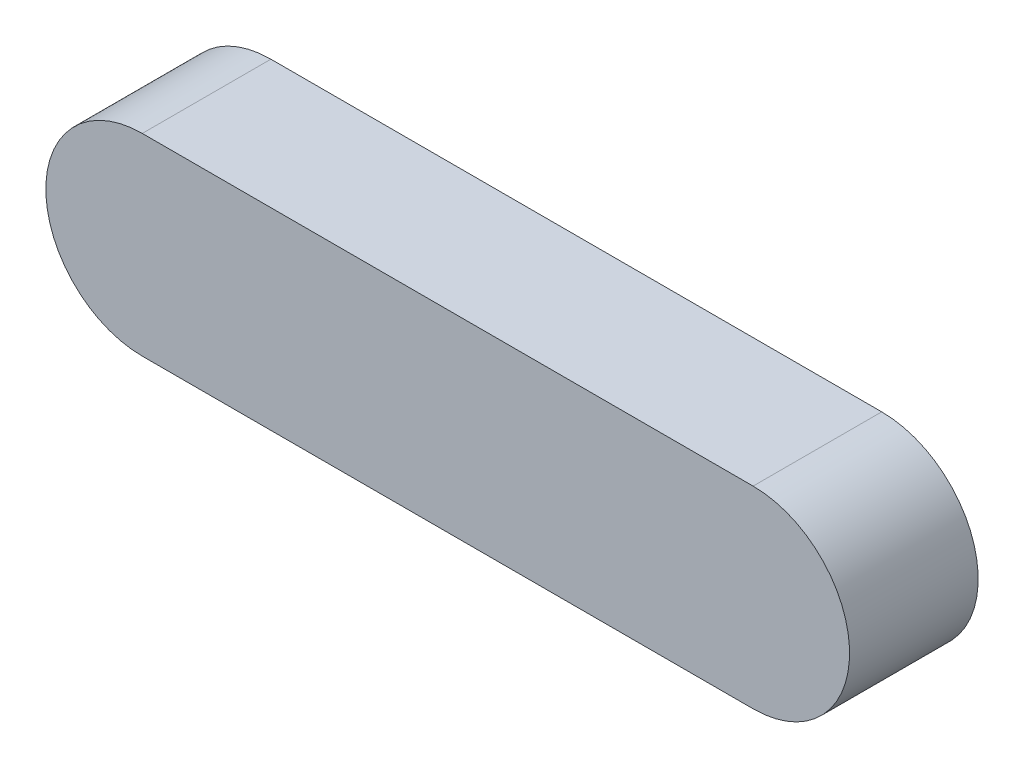
ISO-10303-21;
HEADER;
FILE_DESCRIPTION(('STEP AP214'),'2;1');
FILE_NAME('part.step','',(''),(''),'','','');
FILE_SCHEMA(('AUTOMOTIVE_DESIGN { 1 0 10303 214 1 1 1 1 }'));
ENDSEC;
DATA;
#1=APPLICATION_CONTEXT('core data for automotive mechanical design processes');
#2=APPLICATION_PROTOCOL_DEFINITION('international standard','automotive_design',2000,#1);
#3=PRODUCT_CONTEXT('',#1,'mechanical');
#4=PRODUCT('Part','Part','',(#3));
#5=PRODUCT_RELATED_PRODUCT_CATEGORY('part','',(#4));
#6=PRODUCT_DEFINITION_FORMATION('','',#4);
#7=PRODUCT_DEFINITION_CONTEXT('part definition',#1,'design');
#8=PRODUCT_DEFINITION('design','',#6,#7);
#9=PRODUCT_DEFINITION_SHAPE('','',#8);
#10=(LENGTH_UNIT() NAMED_UNIT(*) SI_UNIT(.MILLI.,.METRE.));
#11=(NAMED_UNIT(*) PLANE_ANGLE_UNIT() SI_UNIT($,.RADIAN.));
#12=(NAMED_UNIT(*) SI_UNIT($,.STERADIAN.) SOLID_ANGLE_UNIT());
#13=UNCERTAINTY_MEASURE_WITH_UNIT(LENGTH_MEASURE(1.E-05),#10,'distance_accuracy_value','');
#14=(GEOMETRIC_REPRESENTATION_CONTEXT(3) GLOBAL_UNCERTAINTY_ASSIGNED_CONTEXT((#13)) GLOBAL_UNIT_ASSIGNED_CONTEXT((#10,
#11,#12)) REPRESENTATION_CONTEXT('',''));
#15=CARTESIAN_POINT('',(0.,0.,0.));
#16=DIRECTION('',(0.,0.,1.));
#17=DIRECTION('',(1.,0.,0.));
#18=AXIS2_PLACEMENT_3D('',#15,#16,#17);
#19=CARTESIAN_POINT('',(-19.,0.,8.));
#20=DIRECTION('',(0.,0.,-1.));
#21=DIRECTION('',(-1.,0.,0.));
#22=AXIS2_PLACEMENT_3D('',#19,#20,#21);
#23=CYLINDRICAL_SURFACE('',#22,6.);
#24=CARTESIAN_POINT('',(-19.,0.,0.));
#25=DIRECTION('',(0.,0.,1.));
#26=DIRECTION('',(1.,0.,0.));
#27=AXIS2_PLACEMENT_3D('',#24,#25,#26);
#28=CIRCLE('',#27,6.);
#29=CARTESIAN_POINT('',(-19.,6.,0.));
#30=VERTEX_POINT('',#29);
#31=CARTESIAN_POINT('',(-19.,-6.,0.));
#32=VERTEX_POINT('',#31);
#33=EDGE_CURVE('E84',#30,#32,#28,.T.);
#34=ORIENTED_EDGE('',*,*,#33,.T.);
#35=DIRECTION('',(0.,0.,-1.));
#36=VECTOR('',#35,1.);
#37=CARTESIAN_POINT('',(-19.,-6.,8.));
#38=LINE('',#37,#36);
#39=CARTESIAN_POINT('',(-19.,-6.,8.));
#40=VERTEX_POINT('',#39);
#41=EDGE_CURVE('E11',#40,#32,#38,.T.);
#42=ORIENTED_EDGE('',*,*,#41,.F.);
#43=CARTESIAN_POINT('',(-19.,0.,8.));
#44=DIRECTION('',(0.,0.,1.));
#45=DIRECTION('',(1.,0.,0.));
#46=AXIS2_PLACEMENT_3D('',#43,#44,#45);
#47=CIRCLE('',#46,6.);
#48=CARTESIAN_POINT('',(-19.,6.,8.));
#49=VERTEX_POINT('',#48);
#50=EDGE_CURVE('E100',#49,#40,#47,.T.);
#51=ORIENTED_EDGE('',*,*,#50,.F.);
#52=DIRECTION('',(0.,0.,-1.));
#53=VECTOR('',#52,1.);
#54=CARTESIAN_POINT('',(-19.,6.,8.));
#55=LINE('',#54,#53);
#56=EDGE_CURVE('E44',#49,#30,#55,.T.);
#57=ORIENTED_EDGE('',*,*,#56,.T.);
#58=EDGE_LOOP('',(#34,#42,#51,#57));
#59=FACE_BOUND('',#58,.T.);
#60=ADVANCED_FACE('F36',(#59),#23,.T.);
#61=CARTESIAN_POINT('',(0.,-6.,8.));
#62=DIRECTION('',(0.,1.,0.));
#63=DIRECTION('',(-1.,0.,0.));
#64=AXIS2_PLACEMENT_3D('',#61,#62,#63);
#65=PLANE('',#64);
#66=DIRECTION('',(1.,0.,0.));
#67=VECTOR('',#66,1.);
#68=CARTESIAN_POINT('',(0.,-6.,0.));
#69=LINE('',#68,#67);
#70=CARTESIAN_POINT('',(19.,-6.,0.));
#71=VERTEX_POINT('',#70);
#72=EDGE_CURVE('E64',#32,#71,#69,.T.);
#73=ORIENTED_EDGE('',*,*,#72,.T.);
#74=DIRECTION('',(0.,0.,-1.));
#75=VECTOR('',#74,1.);
#76=CARTESIAN_POINT('',(19.,-6.,8.));
#77=LINE('',#76,#75);
#78=CARTESIAN_POINT('',(19.,-6.,8.));
#79=VERTEX_POINT('',#78);
#80=EDGE_CURVE('E79',#79,#71,#77,.T.);
#81=ORIENTED_EDGE('',*,*,#80,.F.);
#82=DIRECTION('',(1.,0.,0.));
#83=VECTOR('',#82,1.);
#84=CARTESIAN_POINT('',(0.,-6.,8.));
#85=LINE('',#84,#83);
#86=EDGE_CURVE('E69',#40,#79,#85,.T.);
#87=ORIENTED_EDGE('',*,*,#86,.F.);
#88=ORIENTED_EDGE('',*,*,#41,.T.);
#89=EDGE_LOOP('',(#73,#81,#87,#88));
#90=FACE_BOUND('',#89,.T.);
#91=ADVANCED_FACE('F78',(#90),#65,.F.);
#92=CARTESIAN_POINT('',(-19.,6.,8.));
#93=DIRECTION('',(0.,-1.,0.));
#94=DIRECTION('',(1.,0.,0.));
#95=AXIS2_PLACEMENT_3D('',#92,#93,#94);
#96=PLANE('',#95);
#97=DIRECTION('',(-1.,0.,0.));
#98=VECTOR('',#97,1.);
#99=CARTESIAN_POINT('',(-19.,6.,0.));
#100=LINE('',#99,#98);
#101=CARTESIAN_POINT('',(19.,6.,0.));
#102=VERTEX_POINT('',#101);
#103=EDGE_CURVE('E83',#102,#30,#100,.T.);
#104=ORIENTED_EDGE('',*,*,#103,.T.);
#105=ORIENTED_EDGE('',*,*,#56,.F.);
#106=DIRECTION('',(-1.,0.,0.));
#107=VECTOR('',#106,1.);
#108=CARTESIAN_POINT('',(-19.,6.,8.));
#109=LINE('',#108,#107);
#110=CARTESIAN_POINT('',(19.,6.,8.));
#111=VERTEX_POINT('',#110);
#112=EDGE_CURVE('E52',#111,#49,#109,.T.);
#113=ORIENTED_EDGE('',*,*,#112,.F.);
#114=DIRECTION('',(0.,0.,-1.));
#115=VECTOR('',#114,1.);
#116=CARTESIAN_POINT('',(19.,6.,8.));
#117=LINE('',#116,#115);
#118=EDGE_CURVE('E92',#111,#102,#117,.T.);
#119=ORIENTED_EDGE('',*,*,#118,.T.);
#120=EDGE_LOOP('',(#104,#105,#113,#119));
#121=FACE_BOUND('',#120,.T.);
#122=ADVANCED_FACE('F109',(#121),#96,.F.);
#123=CARTESIAN_POINT('',(-19.,0.,8.));
#124=DIRECTION('',(0.,0.,1.));
#125=DIRECTION('',(1.,0.,0.));
#126=AXIS2_PLACEMENT_3D('',#123,#124,#125);
#127=PLANE('',#126);
#128=ORIENTED_EDGE('',*,*,#50,.T.);
#129=ORIENTED_EDGE('',*,*,#86,.T.);
#130=CARTESIAN_POINT('',(19.,0.,8.));
#131=DIRECTION('',(0.,0.,-1.));
#132=DIRECTION('',(-1.,0.,0.));
#133=AXIS2_PLACEMENT_3D('',#130,#131,#132);
#134=CIRCLE('',#133,6.);
#135=EDGE_CURVE('E91',#111,#79,#134,.T.);
#136=ORIENTED_EDGE('',*,*,#135,.F.);
#137=ORIENTED_EDGE('',*,*,#112,.T.);
#138=EDGE_LOOP('',(#128,#129,#136,#137));
#139=FACE_BOUND('',#138,.T.);
#140=ADVANCED_FACE('F110',(#139),#127,.T.);
#141=CARTESIAN_POINT('',(-19.,0.,0.));
#142=DIRECTION('',(0.,0.,1.));
#143=DIRECTION('',(1.,0.,0.));
#144=AXIS2_PLACEMENT_3D('',#141,#142,#143);
#145=PLANE('',#144);
#146=ORIENTED_EDGE('',*,*,#33,.F.);
#147=ORIENTED_EDGE('',*,*,#103,.F.);
#148=CARTESIAN_POINT('',(19.,0.,0.));
#149=DIRECTION('',(0.,0.,-1.));
#150=DIRECTION('',(-1.,0.,0.));
#151=AXIS2_PLACEMENT_3D('',#148,#149,#150);
#152=CIRCLE('',#151,6.);
#153=EDGE_CURVE('E90',#102,#71,#152,.T.);
#154=ORIENTED_EDGE('',*,*,#153,.T.);
#155=ORIENTED_EDGE('',*,*,#72,.F.);
#156=EDGE_LOOP('',(#146,#147,#154,#155));
#157=FACE_BOUND('',#156,.T.);
#158=ADVANCED_FACE('F94',(#157),#145,.F.);
#159=CARTESIAN_POINT('',(19.,0.,8.));
#160=DIRECTION('',(0.,0.,-1.));
#161=DIRECTION('',(-1.,0.,0.));
#162=AXIS2_PLACEMENT_3D('',#159,#160,#161);
#163=CYLINDRICAL_SURFACE('',#162,6.);
#164=ORIENTED_EDGE('',*,*,#153,.F.);
#165=ORIENTED_EDGE('',*,*,#118,.F.);
#166=ORIENTED_EDGE('',*,*,#135,.T.);
#167=ORIENTED_EDGE('',*,*,#80,.T.);
#168=EDGE_LOOP('',(#164,#165,#166,#167));
#169=FACE_BOUND('',#168,.T.);
#170=ADVANCED_FACE('F88',(#169),#163,.T.);
#171=CLOSED_SHELL('',(#60,#91,#122,#140,#158,#170));
#172=MANIFOLD_SOLID_BREP('B2',#171);
#173=ADVANCED_BREP_SHAPE_REPRESENTATION('',(#18,#172),#14);
#174=SHAPE_DEFINITION_REPRESENTATION(#9,#173);
ENDSEC;
END-ISO-10303-21;
